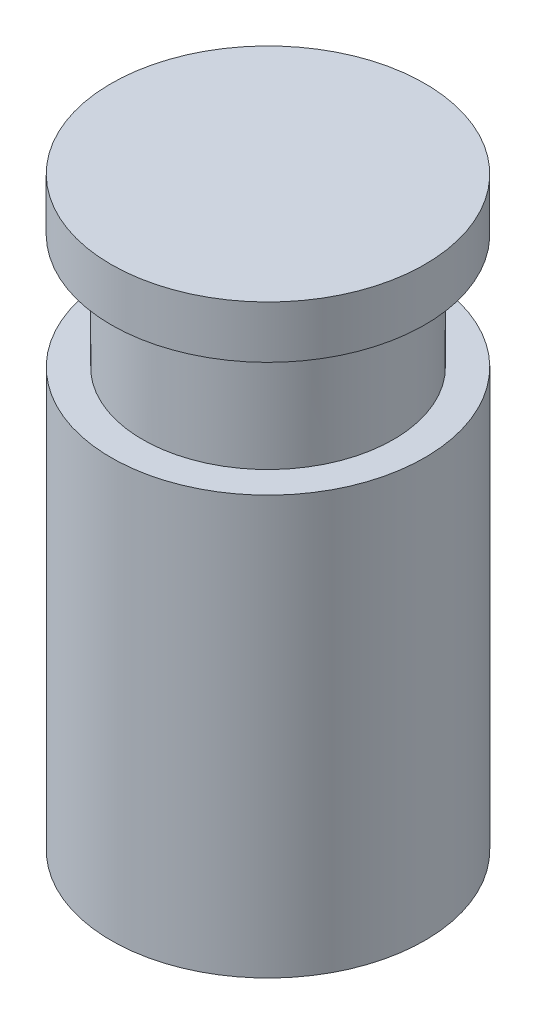
ISO-10303-21;
HEADER;
FILE_DESCRIPTION(('STEP AP214'),'2;1');
FILE_NAME('part.step','',(''),(''),'','','');
FILE_SCHEMA(('AUTOMOTIVE_DESIGN { 1 0 10303 214 1 1 1 1 }'));
ENDSEC;
DATA;
#1=APPLICATION_CONTEXT('core data for automotive mechanical design processes');
#2=APPLICATION_PROTOCOL_DEFINITION('international standard','automotive_design',2000,#1);
#3=PRODUCT_CONTEXT('',#1,'mechanical');
#4=PRODUCT('Part','Part','',(#3));
#5=PRODUCT_RELATED_PRODUCT_CATEGORY('part','',(#4));
#6=PRODUCT_DEFINITION_FORMATION('','',#4);
#7=PRODUCT_DEFINITION_CONTEXT('part definition',#1,'design');
#8=PRODUCT_DEFINITION('design','',#6,#7);
#9=PRODUCT_DEFINITION_SHAPE('','',#8);
#10=(LENGTH_UNIT() NAMED_UNIT(*) SI_UNIT(.MILLI.,.METRE.));
#11=(NAMED_UNIT(*) PLANE_ANGLE_UNIT() SI_UNIT($,.RADIAN.));
#12=(NAMED_UNIT(*) SI_UNIT($,.STERADIAN.) SOLID_ANGLE_UNIT());
#13=UNCERTAINTY_MEASURE_WITH_UNIT(LENGTH_MEASURE(1.E-05),#10,'distance_accuracy_value','');
#14=(GEOMETRIC_REPRESENTATION_CONTEXT(3) GLOBAL_UNCERTAINTY_ASSIGNED_CONTEXT((#13)) GLOBAL_UNIT_ASSIGNED_CONTEXT((#10,
#11,#12)) REPRESENTATION_CONTEXT('',''));
#15=CARTESIAN_POINT('',(0.,0.,0.));
#16=DIRECTION('',(0.,0.,1.));
#17=DIRECTION('',(1.,0.,0.));
#18=AXIS2_PLACEMENT_3D('',#15,#16,#17);
#19=CARTESIAN_POINT('',(0.,8.,0.));
#20=DIRECTION('',(0.,-1.,0.));
#21=DIRECTION('',(0.,0.,-1.));
#22=AXIS2_PLACEMENT_3D('',#19,#20,#21);
#23=CYLINDRICAL_SURFACE('',#22,6.);
#24=CARTESIAN_POINT('',(0.,0.,0.));
#25=DIRECTION('',(0.,-1.,0.));
#26=DIRECTION('',(0.,0.,-1.));
#27=AXIS2_PLACEMENT_3D('',#24,#25,#26);
#28=CIRCLE('',#27,6.);
#29=CARTESIAN_POINT('',(0.,0.,-6.));
#30=VERTEX_POINT('',#29);
#31=EDGE_CURVE('E43',#30,#30,#28,.T.);
#32=ORIENTED_EDGE('',*,*,#31,.F.);
#33=EDGE_LOOP('',(#32));
#34=FACE_BOUND('',#33,.T.);
#35=CARTESIAN_POINT('',(0.,5.5,0.));
#36=DIRECTION('',(0.,1.,0.));
#37=DIRECTION('',(0.,0.,1.));
#38=AXIS2_PLACEMENT_3D('',#35,#36,#37);
#39=CIRCLE('',#38,6.);
#40=CARTESIAN_POINT('',(0.,5.5,6.));
#41=VERTEX_POINT('',#40);
#42=EDGE_CURVE('E10',#41,#41,#39,.T.);
#43=ORIENTED_EDGE('',*,*,#42,.F.);
#44=EDGE_LOOP('',(#43));
#45=FACE_BOUND('',#44,.T.);
#46=ADVANCED_FACE('F37',(#34,#45),#23,.T.);
#47=CARTESIAN_POINT('',(0.,0.,0.));
#48=DIRECTION('',(0.,-1.,0.));
#49=DIRECTION('',(0.,0.,-1.));
#50=AXIS2_PLACEMENT_3D('',#47,#48,#49);
#51=PLANE('',#50);
#52=CARTESIAN_POINT('',(0.,0.,0.));
#53=DIRECTION('',(0.,-1.,0.));
#54=DIRECTION('',(0.,0.,-1.));
#55=AXIS2_PLACEMENT_3D('',#52,#53,#54);
#56=CIRCLE('',#55,7.5);
#57=CARTESIAN_POINT('',(0.,0.,-7.5));
#58=VERTEX_POINT('',#57);
#59=EDGE_CURVE('E51',#58,#58,#56,.T.);
#60=ORIENTED_EDGE('',*,*,#59,.F.);
#61=EDGE_LOOP('',(#60));
#62=FACE_BOUND('',#61,.T.);
#63=ORIENTED_EDGE('',*,*,#31,.T.);
#64=EDGE_LOOP('',(#63));
#65=FACE_BOUND('',#64,.T.);
#66=ADVANCED_FACE('F80',(#62,#65),#51,.F.);
#67=CARTESIAN_POINT('',(0.,-20.,0.));
#68=DIRECTION('',(0.,1.,0.));
#69=DIRECTION('',(0.,0.,1.));
#70=AXIS2_PLACEMENT_3D('',#67,#68,#69);
#71=CYLINDRICAL_SURFACE('',#70,7.5);
#72=CARTESIAN_POINT('',(0.,-20.,0.));
#73=DIRECTION('',(0.,-1.,0.));
#74=DIRECTION('',(0.,0.,-1.));
#75=AXIS2_PLACEMENT_3D('',#72,#73,#74);
#76=CIRCLE('',#75,7.5);
#77=CARTESIAN_POINT('',(0.,-20.,-7.5));
#78=VERTEX_POINT('',#77);
#79=EDGE_CURVE('E47',#78,#78,#76,.T.);
#80=ORIENTED_EDGE('',*,*,#79,.F.);
#81=EDGE_LOOP('',(#80));
#82=FACE_BOUND('',#81,.T.);
#83=ORIENTED_EDGE('',*,*,#59,.T.);
#84=EDGE_LOOP('',(#83));
#85=FACE_BOUND('',#84,.T.);
#86=ADVANCED_FACE('F76',(#82,#85),#71,.T.);
#87=CARTESIAN_POINT('',(0.,-20.,0.));
#88=DIRECTION('',(0.,-1.,0.));
#89=DIRECTION('',(0.,0.,-1.));
#90=AXIS2_PLACEMENT_3D('',#87,#88,#89);
#91=PLANE('',#90);
#92=ORIENTED_EDGE('',*,*,#79,.T.);
#93=EDGE_LOOP('',(#92));
#94=FACE_BOUND('',#93,.T.);
#95=ADVANCED_FACE('F68',(#94),#91,.T.);
#96=CARTESIAN_POINT('',(0.,5.5,0.));
#97=DIRECTION('',(0.,1.,0.));
#98=DIRECTION('',(0.,0.,1.));
#99=AXIS2_PLACEMENT_3D('',#96,#97,#98);
#100=PLANE('',#99);
#101=CARTESIAN_POINT('',(0.,5.5,0.));
#102=DIRECTION('',(0.,1.,0.));
#103=DIRECTION('',(0.,0.,1.));
#104=AXIS2_PLACEMENT_3D('',#101,#102,#103);
#105=CIRCLE('',#104,7.5);
#106=CARTESIAN_POINT('',(0.,5.5,7.5));
#107=VERTEX_POINT('',#106);
#108=EDGE_CURVE('E55',#107,#107,#105,.T.);
#109=ORIENTED_EDGE('',*,*,#108,.F.);
#110=EDGE_LOOP('',(#109));
#111=FACE_BOUND('',#110,.T.);
#112=ORIENTED_EDGE('',*,*,#42,.T.);
#113=EDGE_LOOP('',(#112));
#114=FACE_BOUND('',#113,.T.);
#115=ADVANCED_FACE('F66',(#111,#114),#100,.F.);
#116=CARTESIAN_POINT('',(0.,5.5,0.));
#117=DIRECTION('',(0.,1.,0.));
#118=DIRECTION('',(0.,0.,1.));
#119=AXIS2_PLACEMENT_3D('',#116,#117,#118);
#120=CYLINDRICAL_SURFACE('',#119,7.5);
#121=ORIENTED_EDGE('',*,*,#108,.T.);
#122=EDGE_LOOP('',(#121));
#123=FACE_BOUND('',#122,.T.);
#124=CARTESIAN_POINT('',(0.,8.,0.));
#125=DIRECTION('',(0.,1.,0.));
#126=DIRECTION('',(0.,0.,1.));
#127=AXIS2_PLACEMENT_3D('',#124,#125,#126);
#128=CIRCLE('',#127,7.5);
#129=CARTESIAN_POINT('',(0.,8.,7.5));
#130=VERTEX_POINT('',#129);
#131=EDGE_CURVE('E57',#130,#130,#128,.T.);
#132=ORIENTED_EDGE('',*,*,#131,.F.);
#133=EDGE_LOOP('',(#132));
#134=FACE_BOUND('',#133,.T.);
#135=ADVANCED_FACE('F63',(#123,#134),#120,.T.);
#136=CARTESIAN_POINT('',(0.,8.,0.));
#137=DIRECTION('',(0.,1.,0.));
#138=DIRECTION('',(0.,0.,1.));
#139=AXIS2_PLACEMENT_3D('',#136,#137,#138);
#140=PLANE('',#139);
#141=ORIENTED_EDGE('',*,*,#131,.T.);
#142=EDGE_LOOP('',(#141));
#143=FACE_BOUND('',#142,.T.);
#144=ADVANCED_FACE('F74',(#143),#140,.T.);
#145=CLOSED_SHELL('',(#46,#66,#86,#95,#115,#135,#144));
#146=MANIFOLD_SOLID_BREP('B2',#145);
#147=ADVANCED_BREP_SHAPE_REPRESENTATION('',(#18,#146),#14);
#148=SHAPE_DEFINITION_REPRESENTATION(#9,#147);
ENDSEC;
END-ISO-10303-21;
